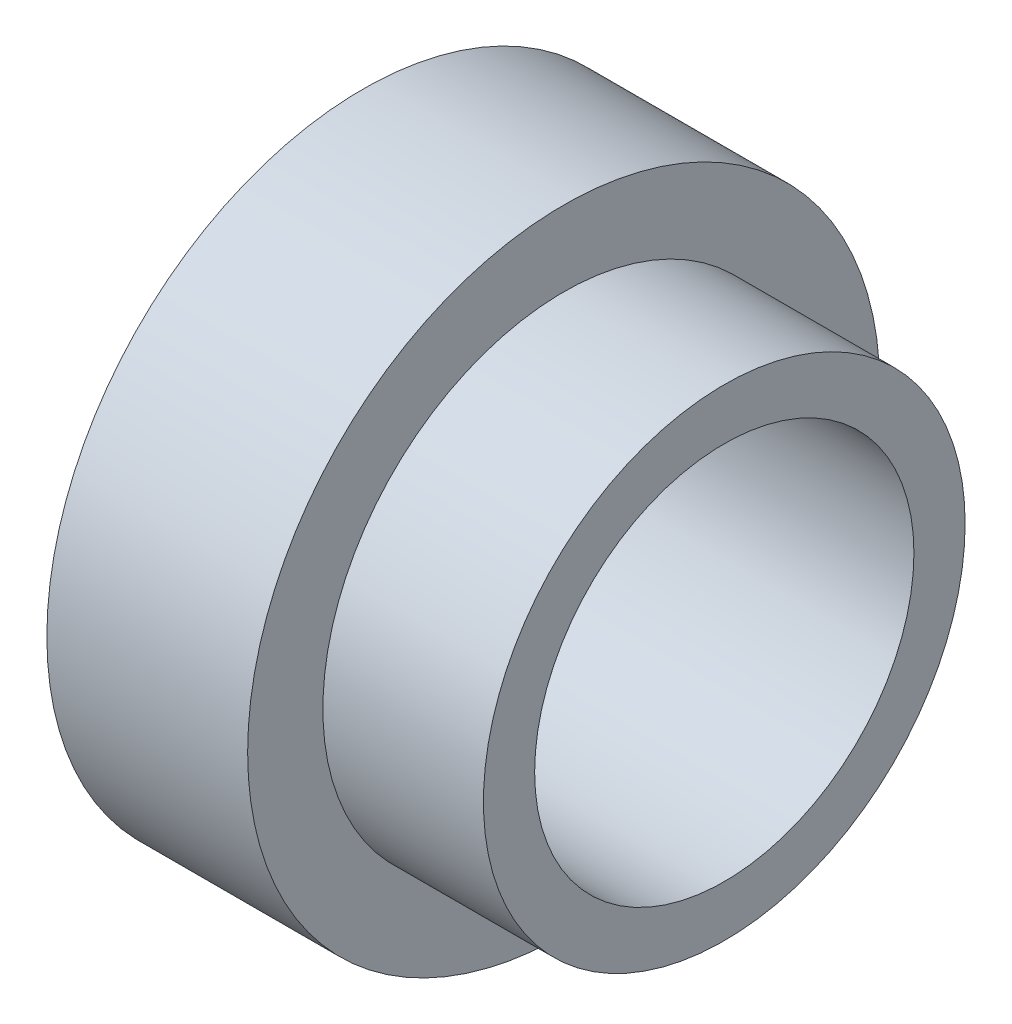
ISO-10303-21;
HEADER;
FILE_DESCRIPTION(('STEP AP214'),'2;1');
FILE_NAME('part.step','',(''),(''),'','','');
FILE_SCHEMA(('AUTOMOTIVE_DESIGN { 1 0 10303 214 1 1 1 1 }'));
ENDSEC;
DATA;
#1=APPLICATION_CONTEXT('core data for automotive mechanical design processes');
#2=APPLICATION_PROTOCOL_DEFINITION('international standard','automotive_design',2000,#1);
#3=PRODUCT_CONTEXT('',#1,'mechanical');
#4=PRODUCT('Part','Part','',(#3));
#5=PRODUCT_RELATED_PRODUCT_CATEGORY('part','',(#4));
#6=PRODUCT_DEFINITION_FORMATION('','',#4);
#7=PRODUCT_DEFINITION_CONTEXT('part definition',#1,'design');
#8=PRODUCT_DEFINITION('design','',#6,#7);
#9=PRODUCT_DEFINITION_SHAPE('','',#8);
#10=(LENGTH_UNIT() NAMED_UNIT(*) SI_UNIT(.MILLI.,.METRE.));
#11=(NAMED_UNIT(*) PLANE_ANGLE_UNIT() SI_UNIT($,.RADIAN.));
#12=(NAMED_UNIT(*) SI_UNIT($,.STERADIAN.) SOLID_ANGLE_UNIT());
#13=UNCERTAINTY_MEASURE_WITH_UNIT(LENGTH_MEASURE(1.E-05),#10,'distance_accuracy_value','');
#14=(GEOMETRIC_REPRESENTATION_CONTEXT(3) GLOBAL_UNCERTAINTY_ASSIGNED_CONTEXT((#13)) GLOBAL_UNIT_ASSIGNED_CONTEXT((#10,
#11,#12)) REPRESENTATION_CONTEXT('',''));
#15=CARTESIAN_POINT('',(0.,0.,0.));
#16=DIRECTION('',(0.,0.,1.));
#17=DIRECTION('',(1.,0.,0.));
#18=AXIS2_PLACEMENT_3D('',#15,#16,#17);
#19=CARTESIAN_POINT('',(7.94,0.,0.));
#20=DIRECTION('',(1.,0.,0.));
#21=DIRECTION('',(0.,0.,-1.));
#22=AXIS2_PLACEMENT_3D('',#19,#20,#21);
#23=PLANE('',#22);
#24=CARTESIAN_POINT('',(7.94,0.,0.));
#25=DIRECTION('',(1.,0.,0.));
#26=DIRECTION('',(0.,0.,-1.));
#27=AXIS2_PLACEMENT_3D('',#24,#25,#26);
#28=CIRCLE('',#27,12.5);
#29=CARTESIAN_POINT('',(7.94,0.,-12.5));
#30=VERTEX_POINT('',#29);
#31=EDGE_CURVE('E10',#30,#30,#28,.T.);
#32=ORIENTED_EDGE('',*,*,#31,.T.);
#33=EDGE_LOOP('',(#32));
#34=FACE_BOUND('',#33,.T.);
#35=CARTESIAN_POINT('',(7.94,0.,0.));
#36=DIRECTION('',(1.,0.,0.));
#37=DIRECTION('',(0.,0.,-1.));
#38=AXIS2_PLACEMENT_3D('',#35,#36,#37);
#39=CIRCLE('',#38,9.525);
#40=CARTESIAN_POINT('',(7.94,0.,-9.525));
#41=VERTEX_POINT('',#40);
#42=EDGE_CURVE('E56',#41,#41,#39,.T.);
#43=ORIENTED_EDGE('',*,*,#42,.F.);
#44=EDGE_LOOP('',(#43));
#45=FACE_BOUND('',#44,.T.);
#46=ADVANCED_FACE('F37',(#34,#45),#23,.T.);
#47=CARTESIAN_POINT('',(0.,0.,0.));
#48=DIRECTION('',(1.,0.,0.));
#49=DIRECTION('',(0.,0.,-1.));
#50=AXIS2_PLACEMENT_3D('',#47,#48,#49);
#51=PLANE('',#50);
#52=CARTESIAN_POINT('',(0.,0.,0.));
#53=DIRECTION('',(1.,0.,0.));
#54=DIRECTION('',(0.,0.,-1.));
#55=AXIS2_PLACEMENT_3D('',#52,#53,#54);
#56=CIRCLE('',#55,12.5);
#57=CARTESIAN_POINT('',(0.,0.,-12.5));
#58=VERTEX_POINT('',#57);
#59=EDGE_CURVE('E41',#58,#58,#56,.T.);
#60=ORIENTED_EDGE('',*,*,#59,.F.);
#61=EDGE_LOOP('',(#60));
#62=FACE_BOUND('',#61,.T.);
#63=CARTESIAN_POINT('',(0.,0.,0.));
#64=DIRECTION('',(1.,0.,0.));
#65=DIRECTION('',(0.,0.,-1.));
#66=AXIS2_PLACEMENT_3D('',#63,#64,#65);
#67=CIRCLE('',#66,7.5);
#68=CARTESIAN_POINT('',(0.,0.,-7.5));
#69=VERTEX_POINT('',#68);
#70=EDGE_CURVE('E50',#69,#69,#67,.T.);
#71=ORIENTED_EDGE('',*,*,#70,.T.);
#72=EDGE_LOOP('',(#71));
#73=FACE_BOUND('',#72,.T.);
#74=ADVANCED_FACE('F84',(#62,#73),#51,.F.);
#75=CARTESIAN_POINT('',(7.94,0.,0.));
#76=DIRECTION('',(-1.,0.,0.));
#77=DIRECTION('',(0.,0.,1.));
#78=AXIS2_PLACEMENT_3D('',#75,#76,#77);
#79=CYLINDRICAL_SURFACE('',#78,12.5);
#80=ORIENTED_EDGE('',*,*,#31,.F.);
#81=EDGE_LOOP('',(#80));
#82=FACE_BOUND('',#81,.T.);
#83=ORIENTED_EDGE('',*,*,#59,.T.);
#84=EDGE_LOOP('',(#83));
#85=FACE_BOUND('',#84,.T.);
#86=ADVANCED_FACE('F39',(#82,#85),#79,.T.);
#87=CARTESIAN_POINT('',(7.94,0.,0.));
#88=DIRECTION('',(-1.,0.,0.));
#89=DIRECTION('',(0.,0.,1.));
#90=AXIS2_PLACEMENT_3D('',#87,#88,#89);
#91=CYLINDRICAL_SURFACE('',#90,7.5);
#92=ORIENTED_EDGE('',*,*,#70,.F.);
#93=EDGE_LOOP('',(#92));
#94=FACE_BOUND('',#93,.T.);
#95=CARTESIAN_POINT('',(14.29,0.,0.));
#96=DIRECTION('',(1.,0.,0.));
#97=DIRECTION('',(0.,0.,-1.));
#98=AXIS2_PLACEMENT_3D('',#95,#96,#97);
#99=CIRCLE('',#98,7.5);
#100=CARTESIAN_POINT('',(14.29,0.,-7.5));
#101=VERTEX_POINT('',#100);
#102=EDGE_CURVE('E60',#101,#101,#99,.T.);
#103=ORIENTED_EDGE('',*,*,#102,.T.);
#104=EDGE_LOOP('',(#103));
#105=FACE_BOUND('',#104,.T.);
#106=ADVANCED_FACE('F68',(#94,#105),#91,.F.);
#107=CARTESIAN_POINT('',(14.29,0.,0.));
#108=DIRECTION('',(1.,0.,0.));
#109=DIRECTION('',(0.,0.,-1.));
#110=AXIS2_PLACEMENT_3D('',#107,#108,#109);
#111=PLANE('',#110);
#112=CARTESIAN_POINT('',(14.29,0.,0.));
#113=DIRECTION('',(1.,0.,0.));
#114=DIRECTION('',(0.,0.,-1.));
#115=AXIS2_PLACEMENT_3D('',#112,#113,#114);
#116=CIRCLE('',#115,9.525);
#117=CARTESIAN_POINT('',(14.29,0.,-9.525));
#118=VERTEX_POINT('',#117);
#119=EDGE_CURVE('E55',#118,#118,#116,.T.);
#120=ORIENTED_EDGE('',*,*,#119,.T.);
#121=EDGE_LOOP('',(#120));
#122=FACE_BOUND('',#121,.T.);
#123=ORIENTED_EDGE('',*,*,#102,.F.);
#124=EDGE_LOOP('',(#123));
#125=FACE_BOUND('',#124,.T.);
#126=ADVANCED_FACE('F70',(#122,#125),#111,.T.);
#127=CARTESIAN_POINT('',(14.29,0.,0.));
#128=DIRECTION('',(-1.,0.,0.));
#129=DIRECTION('',(0.,0.,1.));
#130=AXIS2_PLACEMENT_3D('',#127,#128,#129);
#131=CYLINDRICAL_SURFACE('',#130,9.525);
#132=ORIENTED_EDGE('',*,*,#119,.F.);
#133=EDGE_LOOP('',(#132));
#134=FACE_BOUND('',#133,.T.);
#135=ORIENTED_EDGE('',*,*,#42,.T.);
#136=EDGE_LOOP('',(#135));
#137=FACE_BOUND('',#136,.T.);
#138=ADVANCED_FACE('F72',(#134,#137),#131,.T.);
#139=CLOSED_SHELL('',(#46,#74,#86,#106,#126,#138));
#140=MANIFOLD_SOLID_BREP('B2',#139);
#141=ADVANCED_BREP_SHAPE_REPRESENTATION('',(#18,#140),#14);
#142=SHAPE_DEFINITION_REPRESENTATION(#9,#141);
ENDSEC;
END-ISO-10303-21;
